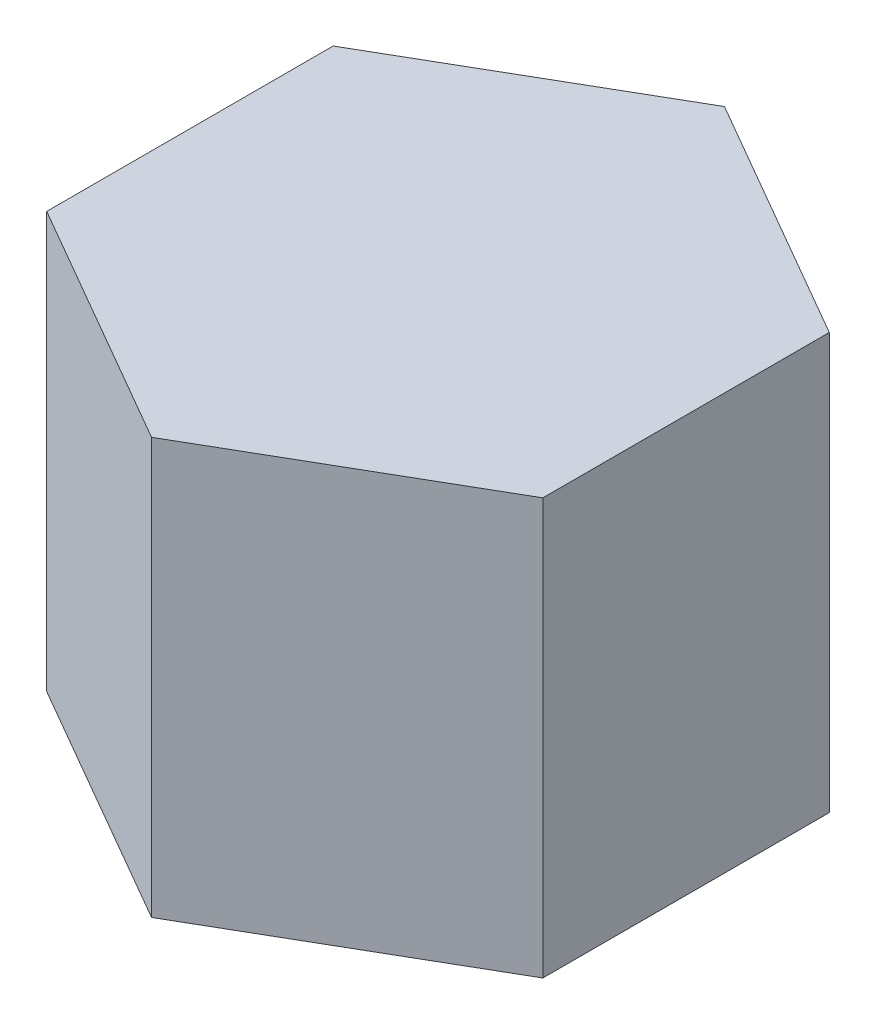
ISO-10303-21;
HEADER;
FILE_DESCRIPTION(('STEP AP214'),'2;1');
FILE_NAME('part.step','',(''),(''),'','','');
FILE_SCHEMA(('AUTOMOTIVE_DESIGN { 1 0 10303 214 1 1 1 1 }'));
ENDSEC;
DATA;
#1=APPLICATION_CONTEXT('core data for automotive mechanical design processes');
#2=APPLICATION_PROTOCOL_DEFINITION('international standard','automotive_design',2000,#1);
#3=PRODUCT_CONTEXT('',#1,'mechanical');
#4=PRODUCT('Part','Part','',(#3));
#5=PRODUCT_RELATED_PRODUCT_CATEGORY('part','',(#4));
#6=PRODUCT_DEFINITION_FORMATION('','',#4);
#7=PRODUCT_DEFINITION_CONTEXT('part definition',#1,'design');
#8=PRODUCT_DEFINITION('design','',#6,#7);
#9=PRODUCT_DEFINITION_SHAPE('','',#8);
#10=(LENGTH_UNIT() NAMED_UNIT(*) SI_UNIT(.MILLI.,.METRE.));
#11=(NAMED_UNIT(*) PLANE_ANGLE_UNIT() SI_UNIT($,.RADIAN.));
#12=(NAMED_UNIT(*) SI_UNIT($,.STERADIAN.) SOLID_ANGLE_UNIT());
#13=UNCERTAINTY_MEASURE_WITH_UNIT(LENGTH_MEASURE(1.E-05),#10,'distance_accuracy_value','');
#14=(GEOMETRIC_REPRESENTATION_CONTEXT(3) GLOBAL_UNCERTAINTY_ASSIGNED_CONTEXT((#13)) GLOBAL_UNIT_ASSIGNED_CONTEXT((#10,
#11,#12)) REPRESENTATION_CONTEXT('',''));
#15=CARTESIAN_POINT('',(0.,0.,0.));
#16=DIRECTION('',(0.,0.,1.));
#17=DIRECTION('',(1.,0.,0.));
#18=AXIS2_PLACEMENT_3D('',#15,#16,#17);
#19=CARTESIAN_POINT('',(206.142660308706,-148.537700895744,294.105047431848));
#20=DIRECTION('',(-0.499999999999909,0.,-0.866025403784491));
#21=DIRECTION('',(-0.866025403784491,0.,0.499999999999909));
#22=AXIS2_PLACEMENT_3D('',#19,#20,#21);
#23=PLANE('',#22);
#24=CARTESIAN_POINT('',(205.839551417381,-149.045793579175,294.280047431848));
#25=DIRECTION('',(0.866025403784491,0.,-0.499999999999909));
#26=VECTOR('',#25,1.);
#27=LINE('',#24,#26);
#28=CARTESIAN_POINT('',(205.839551417382,-149.045793579175,294.280047431848));
#29=VERTEX_POINT('',#28);
#30=CARTESIAN_POINT('',(206.142660308706,-149.045793579175,294.105047431848));
#31=VERTEX_POINT('',#30);
#32=EDGE_CURVE('E170',#29,#31,#27,.T.);
#33=ORIENTED_EDGE('',*,*,#32,.T.);
#34=CARTESIAN_POINT('',(206.142660308706,-148.537700895744,294.105047431848));
#35=DIRECTION('',(0.,-1.,0.));
#36=VECTOR('',#35,1.);
#37=LINE('',#34,#36);
#38=CARTESIAN_POINT('',(206.142660308706,-148.537700895744,294.105047431848));
#39=VERTEX_POINT('',#38);
#40=EDGE_CURVE('E35',#39,#31,#37,.T.);
#41=ORIENTED_EDGE('',*,*,#40,.F.);
#42=CARTESIAN_POINT('',(205.839551417381,-148.537700895744,294.280047431848));
#43=DIRECTION('',(0.866025403784491,0.,-0.499999999999909));
#44=VECTOR('',#43,1.);
#45=LINE('',#42,#44);
#46=CARTESIAN_POINT('',(205.839551417382,-148.537700895744,294.280047431848));
#47=VERTEX_POINT('',#46);
#48=EDGE_CURVE('E159',#47,#39,#45,.T.);
#49=ORIENTED_EDGE('',*,*,#48,.F.);
#50=CARTESIAN_POINT('',(205.839551417381,-148.537700895744,294.280047431848));
#51=DIRECTION('',(0.,-1.,0.));
#52=VECTOR('',#51,1.);
#53=LINE('',#50,#52);
#54=EDGE_CURVE('E10',#47,#29,#53,.T.);
#55=ORIENTED_EDGE('',*,*,#54,.T.);
#56=EDGE_LOOP('',(#33,#41,#49,#55));
#57=FACE_BOUND('',#56,.T.);
#58=ADVANCED_FACE('F16',(#57),#23,.F.);
#59=CARTESIAN_POINT('',(205.839551417382,-148.537700895744,294.280047431848));
#60=DIRECTION('',(0.500000000000062,0.,-0.866025403784403));
#61=DIRECTION('',(-0.866025403784403,0.,-0.500000000000062));
#62=AXIS2_PLACEMENT_3D('',#59,#60,#61);
#63=PLANE('',#62);
#64=CARTESIAN_POINT('',(205.536442526057,-149.045793579175,294.105047431848));
#65=DIRECTION('',(0.866025403784403,0.,0.500000000000062));
#66=VECTOR('',#65,1.);
#67=LINE('',#64,#66);
#68=CARTESIAN_POINT('',(205.536442526057,-149.045793579175,294.105047431848));
#69=VERTEX_POINT('',#68);
#70=EDGE_CURVE('E167',#69,#29,#67,.T.);
#71=ORIENTED_EDGE('',*,*,#70,.T.);
#72=ORIENTED_EDGE('',*,*,#54,.F.);
#73=CARTESIAN_POINT('',(205.536442526057,-148.537700895744,294.105047431848));
#74=DIRECTION('',(0.866025403784403,0.,0.500000000000062));
#75=VECTOR('',#74,1.);
#76=LINE('',#73,#75);
#77=CARTESIAN_POINT('',(205.536442526057,-148.537700895744,294.105047431848));
#78=VERTEX_POINT('',#77);
#79=EDGE_CURVE('E156',#78,#47,#76,.T.);
#80=ORIENTED_EDGE('',*,*,#79,.F.);
#81=CARTESIAN_POINT('',(205.536442526057,-148.537700895744,294.105047431848));
#82=DIRECTION('',(0.,-1.,0.));
#83=VECTOR('',#82,1.);
#84=LINE('',#81,#83);
#85=EDGE_CURVE('E27',#78,#69,#84,.T.);
#86=ORIENTED_EDGE('',*,*,#85,.T.);
#87=EDGE_LOOP('',(#71,#72,#80,#86));
#88=FACE_BOUND('',#87,.T.);
#89=ADVANCED_FACE('F189',(#88),#63,.F.);
#90=CARTESIAN_POINT('',(205.536442526057,-148.537700895744,290.831971220494));
#91=DIRECTION('',(1.,0.,0.));
#92=DIRECTION('',(0.,1.,0.));
#93=AXIS2_PLACEMENT_3D('',#90,#91,#92);
#94=PLANE('',#93);
#95=CARTESIAN_POINT('',(205.536442526057,-149.045793579175,293.755047431848));
#96=DIRECTION('',(0.,0.,1.));
#97=VECTOR('',#96,1.);
#98=LINE('',#95,#97);
#99=CARTESIAN_POINT('',(205.536442526057,-149.045793579175,293.755047431848));
#100=VERTEX_POINT('',#99);
#101=EDGE_CURVE('E163',#100,#69,#98,.T.);
#102=ORIENTED_EDGE('',*,*,#101,.T.);
#103=ORIENTED_EDGE('',*,*,#85,.F.);
#104=CARTESIAN_POINT('',(205.536442526057,-148.537700895744,293.755047431848));
#105=DIRECTION('',(0.,0.,1.));
#106=VECTOR('',#105,1.);
#107=LINE('',#104,#106);
#108=CARTESIAN_POINT('',(205.536442526057,-148.537700895744,293.755047431848));
#109=VERTEX_POINT('',#108);
#110=EDGE_CURVE('E106',#109,#78,#107,.T.);
#111=ORIENTED_EDGE('',*,*,#110,.F.);
#112=CARTESIAN_POINT('',(205.536442526057,-148.537700895744,293.755047431848));
#113=DIRECTION('',(0.,-1.,0.));
#114=VECTOR('',#113,1.);
#115=LINE('',#112,#114);
#116=EDGE_CURVE('E94',#109,#100,#115,.T.);
#117=ORIENTED_EDGE('',*,*,#116,.T.);
#118=EDGE_LOOP('',(#102,#103,#111,#117));
#119=FACE_BOUND('',#118,.T.);
#120=ADVANCED_FACE('F198',(#119),#94,.F.);
#121=CARTESIAN_POINT('',(205.536442526057,-148.537700895744,293.755047431848));
#122=DIRECTION('',(0.499999999999978,0.,0.866025403784452));
#123=DIRECTION('',(0.866025403784452,0.,-0.499999999999978));
#124=AXIS2_PLACEMENT_3D('',#121,#122,#123);
#125=PLANE('',#124);
#126=CARTESIAN_POINT('',(205.839551417382,-149.045793579175,293.580047431848));
#127=DIRECTION('',(-0.866025403784452,0.,0.499999999999978));
#128=VECTOR('',#127,1.);
#129=LINE('',#126,#128);
#130=CARTESIAN_POINT('',(205.839551417382,-149.045793579175,293.580047431848));
#131=VERTEX_POINT('',#130);
#132=EDGE_CURVE('E162',#131,#100,#129,.T.);
#133=ORIENTED_EDGE('',*,*,#132,.T.);
#134=ORIENTED_EDGE('',*,*,#116,.F.);
#135=CARTESIAN_POINT('',(205.839551417382,-148.537700895744,293.580047431848));
#136=DIRECTION('',(-0.866025403784452,0.,0.499999999999978));
#137=VECTOR('',#136,1.);
#138=LINE('',#135,#137);
#139=CARTESIAN_POINT('',(205.839551417382,-148.537700895744,293.580047431848));
#140=VERTEX_POINT('',#139);
#141=EDGE_CURVE('E98',#140,#109,#138,.T.);
#142=ORIENTED_EDGE('',*,*,#141,.F.);
#143=CARTESIAN_POINT('',(205.839551417382,-148.537700895744,293.580047431848));
#144=DIRECTION('',(0.,-1.,0.));
#145=VECTOR('',#144,1.);
#146=LINE('',#143,#145);
#147=EDGE_CURVE('E79',#140,#131,#146,.T.);
#148=ORIENTED_EDGE('',*,*,#147,.T.);
#149=EDGE_LOOP('',(#133,#134,#142,#148));
#150=FACE_BOUND('',#149,.T.);
#151=ADVANCED_FACE('F100',(#150),#125,.F.);
#152=CARTESIAN_POINT('',(205.839551417382,-148.537700895744,293.580047431848));
#153=DIRECTION('',(-0.500000000000012,0.,0.866025403784432));
#154=DIRECTION('',(0.866025403784432,0.,0.500000000000012));
#155=AXIS2_PLACEMENT_3D('',#152,#153,#154);
#156=PLANE('',#155);
#157=CARTESIAN_POINT('',(206.142660308706,-149.045793579175,293.755047431848));
#158=DIRECTION('',(-0.866025403784432,0.,-0.500000000000012));
#159=VECTOR('',#158,1.);
#160=LINE('',#157,#159);
#161=CARTESIAN_POINT('',(206.142660308706,-149.045793579175,293.755047431848));
#162=VERTEX_POINT('',#161);
#163=EDGE_CURVE('E88',#162,#131,#160,.T.);
#164=ORIENTED_EDGE('',*,*,#163,.T.);
#165=ORIENTED_EDGE('',*,*,#147,.F.);
#166=CARTESIAN_POINT('',(206.142660308706,-148.537700895744,293.755047431848));
#167=DIRECTION('',(-0.866025403784432,0.,-0.500000000000012));
#168=VECTOR('',#167,1.);
#169=LINE('',#166,#168);
#170=CARTESIAN_POINT('',(206.142660308706,-148.537700895744,293.755047431848));
#171=VERTEX_POINT('',#170);
#172=EDGE_CURVE('E84',#171,#140,#169,.T.);
#173=ORIENTED_EDGE('',*,*,#172,.F.);
#174=CARTESIAN_POINT('',(206.142660308706,-148.537700895744,293.755047431848));
#175=DIRECTION('',(0.,-1.,0.));
#176=VECTOR('',#175,1.);
#177=LINE('',#174,#176);
#178=EDGE_CURVE('E58',#171,#162,#177,.T.);
#179=ORIENTED_EDGE('',*,*,#178,.T.);
#180=EDGE_LOOP('',(#164,#165,#173,#179));
#181=FACE_BOUND('',#180,.T.);
#182=ADVANCED_FACE('F82',(#181),#156,.F.);
#183=CARTESIAN_POINT('',(206.142660308706,-148.537700895744,290.831971220494));
#184=DIRECTION('',(-1.,0.,0.));
#185=DIRECTION('',(0.,-1.,0.));
#186=AXIS2_PLACEMENT_3D('',#183,#184,#185);
#187=PLANE('',#186);
#188=CARTESIAN_POINT('',(206.142660308706,-149.045793579175,294.105047431848));
#189=DIRECTION('',(0.,0.,-1.));
#190=VECTOR('',#189,1.);
#191=LINE('',#188,#190);
#192=EDGE_CURVE('E160',#31,#162,#191,.T.);
#193=ORIENTED_EDGE('',*,*,#192,.T.);
#194=ORIENTED_EDGE('',*,*,#178,.F.);
#195=CARTESIAN_POINT('',(206.142660308706,-148.537700895744,294.105047431848));
#196=DIRECTION('',(0.,0.,-1.));
#197=VECTOR('',#196,1.);
#198=LINE('',#195,#197);
#199=EDGE_CURVE('E112',#39,#171,#198,.T.);
#200=ORIENTED_EDGE('',*,*,#199,.F.);
#201=ORIENTED_EDGE('',*,*,#40,.T.);
#202=EDGE_LOOP('',(#193,#194,#200,#201));
#203=FACE_BOUND('',#202,.T.);
#204=ADVANCED_FACE('F131',(#203),#187,.F.);
#205=CARTESIAN_POINT('',(206.339551417382,-148.537700895744,290.831971220494));
#206=DIRECTION('',(0.,-1.,0.));
#207=DIRECTION('',(1.,0.,0.));
#208=AXIS2_PLACEMENT_3D('',#205,#206,#207);
#209=PLANE('',#208);
#210=ORIENTED_EDGE('',*,*,#48,.T.);
#211=ORIENTED_EDGE('',*,*,#199,.T.);
#212=ORIENTED_EDGE('',*,*,#172,.T.);
#213=ORIENTED_EDGE('',*,*,#141,.T.);
#214=ORIENTED_EDGE('',*,*,#110,.T.);
#215=ORIENTED_EDGE('',*,*,#79,.T.);
#216=EDGE_LOOP('',(#210,#211,#212,#213,#214,#215));
#217=FACE_BOUND('',#216,.T.);
#218=ADVANCED_FACE('F111',(#217),#209,.F.);
#219=CARTESIAN_POINT('',(206.339551417382,-149.045793579175,290.831971220494));
#220=DIRECTION('',(0.,-1.,0.));
#221=DIRECTION('',(1.,0.,0.));
#222=AXIS2_PLACEMENT_3D('',#219,#220,#221);
#223=PLANE('',#222);
#224=ORIENTED_EDGE('',*,*,#32,.F.);
#225=ORIENTED_EDGE('',*,*,#70,.F.);
#226=ORIENTED_EDGE('',*,*,#101,.F.);
#227=ORIENTED_EDGE('',*,*,#132,.F.);
#228=ORIENTED_EDGE('',*,*,#163,.F.);
#229=ORIENTED_EDGE('',*,*,#192,.F.);
#230=EDGE_LOOP('',(#224,#225,#226,#227,#228,#229));
#231=FACE_BOUND('',#230,.T.);
#232=ADVANCED_FACE('F130',(#231),#223,.T.);
#233=CLOSED_SHELL('',(#58,#89,#120,#151,#182,#204,#218,#232));
#234=MANIFOLD_SOLID_BREP('B1',#233);
#235=ADVANCED_BREP_SHAPE_REPRESENTATION('',(#18,#234),#14);
#236=SHAPE_DEFINITION_REPRESENTATION(#9,#235);
ENDSEC;
END-ISO-10303-21;
